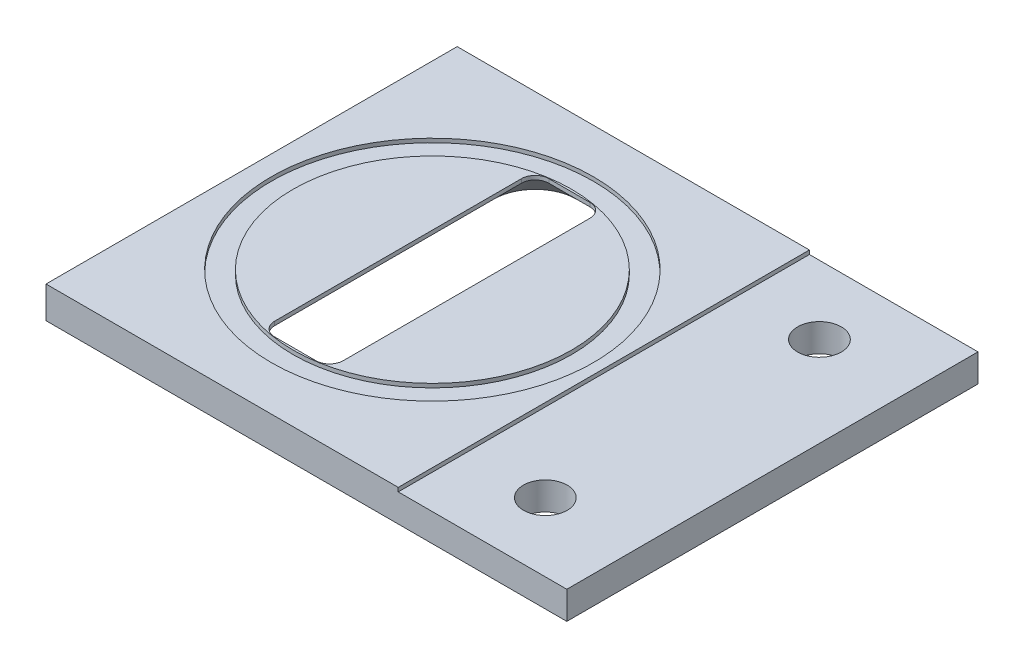
ISO-10303-21;
HEADER;
FILE_DESCRIPTION(('STEP AP214'),'2;1');
FILE_NAME('part.step','',(''),(''),'','','');
FILE_SCHEMA(('AUTOMOTIVE_DESIGN { 1 0 10303 214 1 1 1 1 }'));
ENDSEC;
DATA;
#1=APPLICATION_CONTEXT('core data for automotive mechanical design processes');
#2=APPLICATION_PROTOCOL_DEFINITION('international standard','automotive_design',2000,#1);
#3=PRODUCT_CONTEXT('',#1,'mechanical');
#4=PRODUCT('Part','Part','',(#3));
#5=PRODUCT_RELATED_PRODUCT_CATEGORY('part','',(#4));
#6=PRODUCT_DEFINITION_FORMATION('','',#4);
#7=PRODUCT_DEFINITION_CONTEXT('part definition',#1,'design');
#8=PRODUCT_DEFINITION('design','',#6,#7);
#9=PRODUCT_DEFINITION_SHAPE('','',#8);
#10=(LENGTH_UNIT() NAMED_UNIT(*) SI_UNIT(.MILLI.,.METRE.));
#11=(NAMED_UNIT(*) PLANE_ANGLE_UNIT() SI_UNIT($,.RADIAN.));
#12=(NAMED_UNIT(*) SI_UNIT($,.STERADIAN.) SOLID_ANGLE_UNIT());
#13=UNCERTAINTY_MEASURE_WITH_UNIT(LENGTH_MEASURE(1.E-05),#10,'distance_accuracy_value','');
#14=(GEOMETRIC_REPRESENTATION_CONTEXT(3) GLOBAL_UNCERTAINTY_ASSIGNED_CONTEXT((#13)) GLOBAL_UNIT_ASSIGNED_CONTEXT((#10,
#11,#12)) REPRESENTATION_CONTEXT('',''));
#15=CARTESIAN_POINT('',(0.,0.,0.));
#16=DIRECTION('',(0.,0.,1.));
#17=DIRECTION('',(1.,0.,0.));
#18=AXIS2_PLACEMENT_3D('',#15,#16,#17);
#19=CARTESIAN_POINT('',(0.,2.032,0.));
#20=DIRECTION('',(0.,1.,0.));
#21=DIRECTION('',(0.,0.,1.));
#22=AXIS2_PLACEMENT_3D('',#19,#20,#21);
#23=PLANE('',#22);
#24=CARTESIAN_POINT('',(0.,2.032,0.));
#25=DIRECTION('',(0.,1.,0.));
#26=DIRECTION('',(0.,0.,1.));
#27=AXIS2_PLACEMENT_3D('',#24,#25,#26);
#28=CIRCLE('',#27,10.1624999999998);
#29=CARTESIAN_POINT('',(0.,2.032,10.1624999999998));
#30=VERTEX_POINT('',#29);
#31=EDGE_CURVE('E196',#30,#30,#28,.T.);
#32=ORIENTED_EDGE('',*,*,#31,.F.);
#33=EDGE_LOOP('',(#32));
#34=FACE_BOUND('',#33,.T.);
#35=CARTESIAN_POINT('',(0.,2.032,0.));
#36=DIRECTION('',(0.,1.,0.));
#37=DIRECTION('',(0.,0.,1.));
#38=AXIS2_PLACEMENT_3D('',#35,#36,#37);
#39=CIRCLE('',#38,11.75);
#40=CARTESIAN_POINT('',(0.,2.032,11.75));
#41=VERTEX_POINT('',#40);
#42=EDGE_CURVE('E202',#41,#41,#39,.T.);
#43=ORIENTED_EDGE('',*,*,#42,.T.);
#44=EDGE_LOOP('',(#43));
#45=FACE_BOUND('',#44,.T.);
#46=ADVANCED_FACE('F51',(#34,#45),#23,.T.);
#47=CARTESIAN_POINT('',(24.811028753507,2.032,-15.));
#48=DIRECTION('',(-1.,0.,0.));
#49=DIRECTION('',(0.,0.,1.));
#50=AXIS2_PLACEMENT_3D('',#47,#48,#49);
#51=PLANE('',#50);
#52=DIRECTION('',(0.,0.,-1.));
#53=VECTOR('',#52,1.);
#54=CARTESIAN_POINT('',(24.811028753507,0.,-15.));
#55=LINE('',#54,#53);
#56=CARTESIAN_POINT('',(24.811028753507,0.,15.));
#57=VERTEX_POINT('',#56);
#58=CARTESIAN_POINT('',(24.811028753507,0.,-15.));
#59=VERTEX_POINT('',#58);
#60=EDGE_CURVE('E290',#57,#59,#55,.T.);
#61=ORIENTED_EDGE('',*,*,#60,.T.);
#62=DIRECTION('',(0.,-1.,0.));
#63=VECTOR('',#62,1.);
#64=CARTESIAN_POINT('',(24.811028753507,2.032,-15.));
#65=LINE('',#64,#63);
#66=CARTESIAN_POINT('',(24.811028753507,2.032,-15.));
#67=VERTEX_POINT('',#66);
#68=EDGE_CURVE('E12',#67,#59,#65,.T.);
#69=ORIENTED_EDGE('',*,*,#68,.F.);
#70=DIRECTION('',(0.,0.,-1.));
#71=VECTOR('',#70,1.);
#72=CARTESIAN_POINT('',(24.811028753507,2.032,-15.));
#73=LINE('',#72,#71);
#74=CARTESIAN_POINT('',(24.811028753507,2.032,15.));
#75=VERTEX_POINT('',#74);
#76=EDGE_CURVE('E310',#75,#67,#73,.T.);
#77=ORIENTED_EDGE('',*,*,#76,.F.);
#78=DIRECTION('',(0.,-1.,0.));
#79=VECTOR('',#78,1.);
#80=CARTESIAN_POINT('',(24.811028753507,2.032,15.));
#81=LINE('',#80,#79);
#82=EDGE_CURVE('E318',#75,#57,#81,.T.);
#83=ORIENTED_EDGE('',*,*,#82,.T.);
#84=EDGE_LOOP('',(#61,#69,#77,#83));
#85=FACE_BOUND('',#84,.T.);
#86=ADVANCED_FACE('F53',(#85),#51,.F.);
#87=CARTESIAN_POINT('',(-13.188971246493,2.032,-15.));
#88=DIRECTION('',(0.,0.,1.));
#89=DIRECTION('',(1.,0.,0.));
#90=AXIS2_PLACEMENT_3D('',#87,#88,#89);
#91=PLANE('',#90);
#92=DIRECTION('',(-1.,0.,0.));
#93=VECTOR('',#92,1.);
#94=CARTESIAN_POINT('',(-13.188971246493,0.,-15.));
#95=LINE('',#94,#93);
#96=CARTESIAN_POINT('',(-13.188971246493,0.,-15.));
#97=VERTEX_POINT('',#96);
#98=EDGE_CURVE('E321',#59,#97,#95,.T.);
#99=ORIENTED_EDGE('',*,*,#98,.T.);
#100=DIRECTION('',(0.,-1.,0.));
#101=VECTOR('',#100,1.);
#102=CARTESIAN_POINT('',(-13.188971246493,2.032,-15.));
#103=LINE('',#102,#101);
#104=CARTESIAN_POINT('',(-13.188971246493,2.3194,-15.));
#105=VERTEX_POINT('',#104);
#106=EDGE_CURVE('E59',#105,#97,#103,.T.);
#107=ORIENTED_EDGE('',*,*,#106,.F.);
#108=DIRECTION('',(-1.,0.,0.));
#109=VECTOR('',#108,1.);
#110=CARTESIAN_POINT('',(0.,2.3194,-15.));
#111=LINE('',#110,#109);
#112=CARTESIAN_POINT('',(12.511028753507,2.3194,-15.));
#113=VERTEX_POINT('',#112);
#114=EDGE_CURVE('E218',#113,#105,#111,.T.);
#115=ORIENTED_EDGE('',*,*,#114,.F.);
#116=DIRECTION('',(0.,-1.,0.));
#117=VECTOR('',#116,1.);
#118=CARTESIAN_POINT('',(12.511028753507,2.3194,-15.));
#119=LINE('',#118,#117);
#120=CARTESIAN_POINT('',(12.511028753507,2.032,-15.));
#121=VERTEX_POINT('',#120);
#122=EDGE_CURVE('E223',#113,#121,#119,.T.);
#123=ORIENTED_EDGE('',*,*,#122,.T.);
#124=DIRECTION('',(-1.,0.,0.));
#125=VECTOR('',#124,1.);
#126=CARTESIAN_POINT('',(-13.188971246493,2.032,-15.));
#127=LINE('',#126,#125);
#128=EDGE_CURVE('E313',#67,#121,#127,.T.);
#129=ORIENTED_EDGE('',*,*,#128,.F.);
#130=ORIENTED_EDGE('',*,*,#68,.T.);
#131=EDGE_LOOP('',(#99,#107,#115,#123,#129,#130));
#132=FACE_BOUND('',#131,.T.);
#133=ADVANCED_FACE('F356',(#132),#91,.F.);
#134=CARTESIAN_POINT('',(-13.188971246493,2.032,-15.));
#135=DIRECTION('',(1.,0.,0.));
#136=DIRECTION('',(0.,0.,-1.));
#137=AXIS2_PLACEMENT_3D('',#134,#135,#136);
#138=PLANE('',#137);
#139=DIRECTION('',(0.,0.,1.));
#140=VECTOR('',#139,1.);
#141=CARTESIAN_POINT('',(-13.188971246493,0.,-15.));
#142=LINE('',#141,#140);
#143=CARTESIAN_POINT('',(-13.188971246493,0.,15.));
#144=VERTEX_POINT('',#143);
#145=EDGE_CURVE('E323',#97,#144,#142,.T.);
#146=ORIENTED_EDGE('',*,*,#145,.T.);
#147=DIRECTION('',(0.,-1.,0.));
#148=VECTOR('',#147,1.);
#149=CARTESIAN_POINT('',(-13.188971246493,2.032,15.));
#150=LINE('',#149,#148);
#151=CARTESIAN_POINT('',(-13.188971246493,2.3194,15.));
#152=VERTEX_POINT('',#151);
#153=EDGE_CURVE('E328',#152,#144,#150,.T.);
#154=ORIENTED_EDGE('',*,*,#153,.F.);
#155=DIRECTION('',(0.,0.,1.));
#156=VECTOR('',#155,1.);
#157=CARTESIAN_POINT('',(-13.188971246493,2.3194,0.));
#158=LINE('',#157,#156);
#159=EDGE_CURVE('E221',#105,#152,#158,.T.);
#160=ORIENTED_EDGE('',*,*,#159,.F.);
#161=ORIENTED_EDGE('',*,*,#106,.T.);
#162=EDGE_LOOP('',(#146,#154,#160,#161));
#163=FACE_BOUND('',#162,.T.);
#164=ADVANCED_FACE('F334',(#163),#138,.F.);
#165=CARTESIAN_POINT('',(-13.188971246493,2.032,15.));
#166=DIRECTION('',(0.,0.,-1.));
#167=DIRECTION('',(-1.,0.,0.));
#168=AXIS2_PLACEMENT_3D('',#165,#166,#167);
#169=PLANE('',#168);
#170=DIRECTION('',(1.,0.,0.));
#171=VECTOR('',#170,1.);
#172=CARTESIAN_POINT('',(-13.188971246493,0.,15.));
#173=LINE('',#172,#171);
#174=EDGE_CURVE('E314',#144,#57,#173,.T.);
#175=ORIENTED_EDGE('',*,*,#174,.T.);
#176=ORIENTED_EDGE('',*,*,#82,.F.);
#177=DIRECTION('',(1.,0.,0.));
#178=VECTOR('',#177,1.);
#179=CARTESIAN_POINT('',(-13.188971246493,2.032,15.));
#180=LINE('',#179,#178);
#181=CARTESIAN_POINT('',(12.511028753507,2.032,15.));
#182=VERTEX_POINT('',#181);
#183=EDGE_CURVE('E316',#182,#75,#180,.T.);
#184=ORIENTED_EDGE('',*,*,#183,.F.);
#185=DIRECTION('',(0.,-1.,0.));
#186=VECTOR('',#185,1.);
#187=CARTESIAN_POINT('',(12.511028753507,2.3194,15.));
#188=LINE('',#187,#186);
#189=CARTESIAN_POINT('',(12.511028753507,2.3194,15.));
#190=VERTEX_POINT('',#189);
#191=EDGE_CURVE('E228',#190,#182,#188,.T.);
#192=ORIENTED_EDGE('',*,*,#191,.F.);
#193=DIRECTION('',(1.,0.,0.));
#194=VECTOR('',#193,1.);
#195=CARTESIAN_POINT('',(0.,2.3194,15.));
#196=LINE('',#195,#194);
#197=EDGE_CURVE('E213',#152,#190,#196,.T.);
#198=ORIENTED_EDGE('',*,*,#197,.F.);
#199=ORIENTED_EDGE('',*,*,#153,.T.);
#200=EDGE_LOOP('',(#175,#176,#184,#192,#198,#199));
#201=FACE_BOUND('',#200,.T.);
#202=ADVANCED_FACE('F343',(#201),#169,.F.);
#203=DIRECTION('',(0.,0.,-1.));
#204=VECTOR('',#203,1.);
#205=CARTESIAN_POINT('',(12.511028753507,2.032,0.));
#206=LINE('',#205,#204);
#207=EDGE_CURVE('E66',#182,#121,#206,.T.);
#208=ORIENTED_EDGE('',*,*,#207,.F.);
#209=ORIENTED_EDGE('',*,*,#183,.T.);
#210=ORIENTED_EDGE('',*,*,#76,.T.);
#211=ORIENTED_EDGE('',*,*,#128,.T.);
#212=EDGE_LOOP('',(#208,#209,#210,#211));
#213=FACE_BOUND('',#212,.T.);
#214=CARTESIAN_POINT('',(18.2427076959604,2.032,10.));
#215=DIRECTION('',(0.,1.,0.));
#216=DIRECTION('',(0.,0.,1.));
#217=AXIS2_PLACEMENT_3D('',#214,#215,#216);
#218=CIRCLE('',#217,1.595);
#219=CARTESIAN_POINT('',(18.2427076959604,2.032,11.595));
#220=VERTEX_POINT('',#219);
#221=EDGE_CURVE('E236',#220,#220,#218,.T.);
#222=ORIENTED_EDGE('',*,*,#221,.F.);
#223=EDGE_LOOP('',(#222));
#224=FACE_BOUND('',#223,.T.);
#225=CARTESIAN_POINT('',(18.2427076959604,2.032,-10.));
#226=DIRECTION('',(0.,1.,0.));
#227=DIRECTION('',(0.,0.,1.));
#228=AXIS2_PLACEMENT_3D('',#225,#226,#227);
#229=CIRCLE('',#228,1.595);
#230=CARTESIAN_POINT('',(18.2427076959604,2.032,-8.405));
#231=VERTEX_POINT('',#230);
#232=EDGE_CURVE('E231',#231,#231,#229,.T.);
#233=ORIENTED_EDGE('',*,*,#232,.F.);
#234=EDGE_LOOP('',(#233));
#235=FACE_BOUND('',#234,.T.);
#236=ADVANCED_FACE('F348',(#213,#224,#235),#23,.T.);
#237=CARTESIAN_POINT('',(0.,0.,0.));
#238=DIRECTION('',(0.,1.,0.));
#239=DIRECTION('',(0.,0.,1.));
#240=AXIS2_PLACEMENT_3D('',#237,#238,#239);
#241=PLANE('',#240);
#242=CARTESIAN_POINT('',(18.2427076959604,0.,10.));
#243=DIRECTION('',(0.,1.,0.));
#244=DIRECTION('',(0.,0.,1.));
#245=AXIS2_PLACEMENT_3D('',#242,#243,#244);
#246=CIRCLE('',#245,1.595);
#247=CARTESIAN_POINT('',(18.2427076959604,0.,11.595));
#248=VERTEX_POINT('',#247);
#249=EDGE_CURVE('E232',#248,#248,#246,.T.);
#250=ORIENTED_EDGE('',*,*,#249,.T.);
#251=EDGE_LOOP('',(#250));
#252=FACE_BOUND('',#251,.T.);
#253=CARTESIAN_POINT('',(18.2427076959604,0.,-10.));
#254=DIRECTION('',(0.,1.,0.));
#255=DIRECTION('',(0.,0.,1.));
#256=AXIS2_PLACEMENT_3D('',#253,#254,#255);
#257=CIRCLE('',#256,1.595);
#258=CARTESIAN_POINT('',(18.2427076959604,0.,-8.405));
#259=VERTEX_POINT('',#258);
#260=EDGE_CURVE('E239',#259,#259,#257,.T.);
#261=ORIENTED_EDGE('',*,*,#260,.T.);
#262=EDGE_LOOP('',(#261));
#263=FACE_BOUND('',#262,.T.);
#264=DIRECTION('',(1.,0.,0.));
#265=VECTOR('',#264,1.);
#266=CARTESIAN_POINT('',(1.5,0.,12.032));
#267=LINE('',#266,#265);
#268=CARTESIAN_POINT('',(-1.5,0.,12.032));
#269=VERTEX_POINT('',#268);
#270=CARTESIAN_POINT('',(1.5,0.,12.032));
#271=VERTEX_POINT('',#270);
#272=EDGE_CURVE('E268',#269,#271,#267,.T.);
#273=ORIENTED_EDGE('',*,*,#272,.T.);
#274=CARTESIAN_POINT('',(1.5,0.,9.));
#275=DIRECTION('',(0.,1.,0.));
#276=DIRECTION('',(0.,0.,1.));
#277=AXIS2_PLACEMENT_3D('',#274,#275,#276);
#278=CIRCLE('',#277,3.03200000000001);
#279=CARTESIAN_POINT('',(4.53200000000001,0.,9.));
#280=VERTEX_POINT('',#279);
#281=EDGE_CURVE('E264',#271,#280,#278,.T.);
#282=ORIENTED_EDGE('',*,*,#281,.T.);
#283=DIRECTION('',(0.,0.,-1.));
#284=VECTOR('',#283,1.);
#285=CARTESIAN_POINT('',(4.53200000000001,0.,9.));
#286=LINE('',#285,#284);
#287=CARTESIAN_POINT('',(4.53200000000001,0.,-9.));
#288=VERTEX_POINT('',#287);
#289=EDGE_CURVE('E267',#280,#288,#286,.T.);
#290=ORIENTED_EDGE('',*,*,#289,.T.);
#291=CARTESIAN_POINT('',(1.5,0.,-9.));
#292=DIRECTION('',(0.,1.,0.));
#293=DIRECTION('',(0.,0.,1.));
#294=AXIS2_PLACEMENT_3D('',#291,#292,#293);
#295=CIRCLE('',#294,3.03200000000001);
#296=CARTESIAN_POINT('',(1.5,0.,-12.032));
#297=VERTEX_POINT('',#296);
#298=EDGE_CURVE('E74',#288,#297,#295,.T.);
#299=ORIENTED_EDGE('',*,*,#298,.T.);
#300=DIRECTION('',(-1.,0.,0.));
#301=VECTOR('',#300,1.);
#302=CARTESIAN_POINT('',(1.5,0.,-12.032));
#303=LINE('',#302,#301);
#304=CARTESIAN_POINT('',(-1.5,0.,-12.032));
#305=VERTEX_POINT('',#304);
#306=EDGE_CURVE('E281',#297,#305,#303,.T.);
#307=ORIENTED_EDGE('',*,*,#306,.T.);
#308=CARTESIAN_POINT('',(-1.5,0.,-9.));
#309=DIRECTION('',(0.,1.,0.));
#310=DIRECTION('',(0.,0.,1.));
#311=AXIS2_PLACEMENT_3D('',#308,#309,#310);
#312=CIRCLE('',#311,3.03200000000001);
#313=CARTESIAN_POINT('',(-4.53200000000001,0.,-9.));
#314=VERTEX_POINT('',#313);
#315=EDGE_CURVE('E278',#305,#314,#312,.T.);
#316=ORIENTED_EDGE('',*,*,#315,.T.);
#317=DIRECTION('',(0.,0.,1.));
#318=VECTOR('',#317,1.);
#319=CARTESIAN_POINT('',(-4.53200000000001,0.,9.));
#320=LINE('',#319,#318);
#321=CARTESIAN_POINT('',(-4.53200000000001,0.,9.));
#322=VERTEX_POINT('',#321);
#323=EDGE_CURVE('E275',#314,#322,#320,.T.);
#324=ORIENTED_EDGE('',*,*,#323,.T.);
#325=CARTESIAN_POINT('',(-1.5,0.,9.));
#326=DIRECTION('',(0.,1.,0.));
#327=DIRECTION('',(0.,0.,1.));
#328=AXIS2_PLACEMENT_3D('',#325,#326,#327);
#329=CIRCLE('',#328,3.03200000000001);
#330=EDGE_CURVE('E272',#322,#269,#329,.T.);
#331=ORIENTED_EDGE('',*,*,#330,.T.);
#332=EDGE_LOOP('',(#273,#282,#290,#299,#307,#316,#324,#331));
#333=FACE_BOUND('',#332,.T.);
#334=ORIENTED_EDGE('',*,*,#60,.F.);
#335=ORIENTED_EDGE('',*,*,#174,.F.);
#336=ORIENTED_EDGE('',*,*,#145,.F.);
#337=ORIENTED_EDGE('',*,*,#98,.F.);
#338=EDGE_LOOP('',(#334,#335,#336,#337));
#339=FACE_BOUND('',#338,.T.);
#340=ADVANCED_FACE('F340',(#252,#263,#333,#339),#241,.F.);
#341=CARTESIAN_POINT('',(1.5,2.032,9.));
#342=DIRECTION('',(0.,-1.,0.));
#343=DIRECTION('',(0.,0.,1.));
#344=AXIS2_PLACEMENT_3D('',#341,#342,#343);
#345=CONICAL_SURFACE('',#344,1.,0.78539816339745);
#346=CARTESIAN_POINT('',(1.5,2.032,9.));
#347=DIRECTION('',(0.,1.,0.));
#348=DIRECTION('',(0.,0.,1.));
#349=AXIS2_PLACEMENT_3D('',#346,#347,#348);
#350=CIRCLE('',#349,1.);
#351=CARTESIAN_POINT('',(1.5,2.032,10.));
#352=VERTEX_POINT('',#351);
#353=CARTESIAN_POINT('',(2.5,2.032,9.));
#354=VERTEX_POINT('',#353);
#355=EDGE_CURVE('E235',#352,#354,#350,.T.);
#356=ORIENTED_EDGE('',*,*,#355,.T.);
#357=DIRECTION('',(0.707106781186549,-0.707106781186546,0.));
#358=VECTOR('',#357,1.);
#359=CARTESIAN_POINT('',(2.5,2.032,9.));
#360=LINE('',#359,#358);
#361=EDGE_CURVE('E271',#280,#354,#360,.F.);
#362=ORIENTED_EDGE('',*,*,#361,.F.);
#363=ORIENTED_EDGE('',*,*,#281,.F.);
#364=DIRECTION('',(0.,-0.707106781186546,0.707106781186549));
#365=VECTOR('',#364,1.);
#366=CARTESIAN_POINT('',(1.5,2.032,10.));
#367=LINE('',#366,#365);
#368=EDGE_CURVE('E287',#271,#352,#367,.F.);
#369=ORIENTED_EDGE('',*,*,#368,.T.);
#370=EDGE_LOOP('',(#356,#362,#363,#369));
#371=FACE_BOUND('',#370,.T.);
#372=ADVANCED_FACE('F377',(#371),#345,.F.);
#373=CARTESIAN_POINT('',(1.5,2.032,10.));
#374=DIRECTION('',(0.,0.707106781186549,0.707106781186546));
#375=DIRECTION('',(0.,-0.707106781186546,0.707106781186549));
#376=AXIS2_PLACEMENT_3D('',#373,#374,#375);
#377=PLANE('',#376);
#378=DIRECTION('',(1.,0.,0.));
#379=VECTOR('',#378,1.);
#380=CARTESIAN_POINT('',(1.5,2.032,10.));
#381=LINE('',#380,#379);
#382=CARTESIAN_POINT('',(-1.5,2.032,10.));
#383=VERTEX_POINT('',#382);
#384=EDGE_CURVE('E261',#383,#352,#381,.T.);
#385=ORIENTED_EDGE('',*,*,#384,.T.);
#386=ORIENTED_EDGE('',*,*,#368,.F.);
#387=ORIENTED_EDGE('',*,*,#272,.F.);
#388=DIRECTION('',(0.,-0.707106781186546,0.707106781186549));
#389=VECTOR('',#388,1.);
#390=CARTESIAN_POINT('',(-1.5,2.032,10.));
#391=LINE('',#390,#389);
#392=EDGE_CURVE('E291',#269,#383,#391,.F.);
#393=ORIENTED_EDGE('',*,*,#392,.T.);
#394=EDGE_LOOP('',(#385,#386,#387,#393));
#395=FACE_BOUND('',#394,.T.);
#396=ADVANCED_FACE('F461',(#395),#377,.F.);
#397=CARTESIAN_POINT('',(-1.5,2.032,9.));
#398=DIRECTION('',(0.,-1.,0.));
#399=DIRECTION('',(0.,0.,-1.));
#400=AXIS2_PLACEMENT_3D('',#397,#398,#399);
#401=CONICAL_SURFACE('',#400,1.,0.78539816339745);
#402=CARTESIAN_POINT('',(-1.5,2.032,9.));
#403=DIRECTION('',(0.,1.,0.));
#404=DIRECTION('',(0.,0.,-1.));
#405=AXIS2_PLACEMENT_3D('',#402,#403,#404);
#406=CIRCLE('',#405,1.);
#407=CARTESIAN_POINT('',(-2.5,2.032,9.));
#408=VERTEX_POINT('',#407);
#409=EDGE_CURVE('E258',#408,#383,#406,.T.);
#410=ORIENTED_EDGE('',*,*,#409,.T.);
#411=ORIENTED_EDGE('',*,*,#392,.F.);
#412=ORIENTED_EDGE('',*,*,#330,.F.);
#413=DIRECTION('',(-0.707106781186549,-0.707106781186546,0.));
#414=VECTOR('',#413,1.);
#415=CARTESIAN_POINT('',(-2.5,2.032,9.));
#416=LINE('',#415,#414);
#417=EDGE_CURVE('E305',#322,#408,#416,.F.);
#418=ORIENTED_EDGE('',*,*,#417,.T.);
#419=EDGE_LOOP('',(#410,#411,#412,#418));
#420=FACE_BOUND('',#419,.T.);
#421=ADVANCED_FACE('F471',(#420),#401,.F.);
#422=CARTESIAN_POINT('',(-2.5,2.032,9.));
#423=DIRECTION('',(-0.707106781186546,0.707106781186549,0.));
#424=DIRECTION('',(-0.707106781186549,-0.707106781186546,0.));
#425=AXIS2_PLACEMENT_3D('',#422,#423,#424);
#426=PLANE('',#425);
#427=DIRECTION('',(0.,0.,1.));
#428=VECTOR('',#427,1.);
#429=CARTESIAN_POINT('',(-2.5,2.032,9.));
#430=LINE('',#429,#428);
#431=CARTESIAN_POINT('',(-2.5,2.032,-9.));
#432=VERTEX_POINT('',#431);
#433=EDGE_CURVE('E255',#432,#408,#430,.T.);
#434=ORIENTED_EDGE('',*,*,#433,.T.);
#435=ORIENTED_EDGE('',*,*,#417,.F.);
#436=ORIENTED_EDGE('',*,*,#323,.F.);
#437=DIRECTION('',(-0.707106781186549,-0.707106781186546,0.));
#438=VECTOR('',#437,1.);
#439=CARTESIAN_POINT('',(-2.5,2.032,-9.));
#440=LINE('',#439,#438);
#441=EDGE_CURVE('E302',#314,#432,#440,.F.);
#442=ORIENTED_EDGE('',*,*,#441,.T.);
#443=EDGE_LOOP('',(#434,#435,#436,#442));
#444=FACE_BOUND('',#443,.T.);
#445=ADVANCED_FACE('F480',(#444),#426,.F.);
#446=CARTESIAN_POINT('',(-1.5,2.032,-9.));
#447=DIRECTION('',(0.,-1.,0.));
#448=DIRECTION('',(0.,0.,1.));
#449=AXIS2_PLACEMENT_3D('',#446,#447,#448);
#450=CONICAL_SURFACE('',#449,1.,0.78539816339745);
#451=CARTESIAN_POINT('',(-1.5,2.032,-9.));
#452=DIRECTION('',(0.,1.,0.));
#453=DIRECTION('',(0.,0.,1.));
#454=AXIS2_PLACEMENT_3D('',#451,#452,#453);
#455=CIRCLE('',#454,1.);
#456=CARTESIAN_POINT('',(-1.5,2.032,-10.));
#457=VERTEX_POINT('',#456);
#458=EDGE_CURVE('E252',#457,#432,#455,.T.);
#459=ORIENTED_EDGE('',*,*,#458,.T.);
#460=ORIENTED_EDGE('',*,*,#441,.F.);
#461=ORIENTED_EDGE('',*,*,#315,.F.);
#462=DIRECTION('',(0.,-0.707106781186546,-0.707106781186549));
#463=VECTOR('',#462,1.);
#464=CARTESIAN_POINT('',(-1.5,2.032,-10.));
#465=LINE('',#464,#463);
#466=EDGE_CURVE('E299',#305,#457,#465,.F.);
#467=ORIENTED_EDGE('',*,*,#466,.T.);
#468=EDGE_LOOP('',(#459,#460,#461,#467));
#469=FACE_BOUND('',#468,.T.);
#470=ADVANCED_FACE('F490',(#469),#450,.F.);
#471=CARTESIAN_POINT('',(1.5,2.032,-10.));
#472=DIRECTION('',(0.,0.707106781186549,-0.707106781186546));
#473=DIRECTION('',(0.,0.707106781186546,0.707106781186549));
#474=AXIS2_PLACEMENT_3D('',#471,#472,#473);
#475=PLANE('',#474);
#476=DIRECTION('',(-1.,0.,0.));
#477=VECTOR('',#476,1.);
#478=CARTESIAN_POINT('',(1.5,2.032,-10.));
#479=LINE('',#478,#477);
#480=CARTESIAN_POINT('',(1.5,2.032,-10.));
#481=VERTEX_POINT('',#480);
#482=EDGE_CURVE('E249',#481,#457,#479,.T.);
#483=ORIENTED_EDGE('',*,*,#482,.T.);
#484=ORIENTED_EDGE('',*,*,#466,.F.);
#485=ORIENTED_EDGE('',*,*,#306,.F.);
#486=DIRECTION('',(0.,-0.707106781186546,-0.707106781186549));
#487=VECTOR('',#486,1.);
#488=CARTESIAN_POINT('',(1.5,2.032,-10.));
#489=LINE('',#488,#487);
#490=EDGE_CURVE('E296',#297,#481,#489,.F.);
#491=ORIENTED_EDGE('',*,*,#490,.T.);
#492=EDGE_LOOP('',(#483,#484,#485,#491));
#493=FACE_BOUND('',#492,.T.);
#494=ADVANCED_FACE('F500',(#493),#475,.F.);
#495=CARTESIAN_POINT('',(1.5,2.032,-9.));
#496=DIRECTION('',(0.,-1.,0.));
#497=DIRECTION('',(0.,0.,1.));
#498=AXIS2_PLACEMENT_3D('',#495,#496,#497);
#499=CONICAL_SURFACE('',#498,1.,0.78539816339745);
#500=CARTESIAN_POINT('',(1.5,2.032,-9.));
#501=DIRECTION('',(0.,1.,0.));
#502=DIRECTION('',(0.,0.,1.));
#503=AXIS2_PLACEMENT_3D('',#500,#501,#502);
#504=CIRCLE('',#503,1.);
#505=CARTESIAN_POINT('',(2.5,2.032,-9.));
#506=VERTEX_POINT('',#505);
#507=EDGE_CURVE('E246',#506,#481,#504,.T.);
#508=ORIENTED_EDGE('',*,*,#507,.T.);
#509=ORIENTED_EDGE('',*,*,#490,.F.);
#510=ORIENTED_EDGE('',*,*,#298,.F.);
#511=DIRECTION('',(0.707106781186549,-0.707106781186546,0.));
#512=VECTOR('',#511,1.);
#513=CARTESIAN_POINT('',(2.5,2.032,-9.));
#514=LINE('',#513,#512);
#515=EDGE_CURVE('E294',#288,#506,#514,.F.);
#516=ORIENTED_EDGE('',*,*,#515,.T.);
#517=EDGE_LOOP('',(#508,#509,#510,#516));
#518=FACE_BOUND('',#517,.T.);
#519=ADVANCED_FACE('F510',(#518),#499,.F.);
#520=CARTESIAN_POINT('',(2.5,2.032,9.));
#521=DIRECTION('',(0.707106781186546,0.707106781186549,0.));
#522=DIRECTION('',(-0.707106781186549,0.707106781186546,0.));
#523=AXIS2_PLACEMENT_3D('',#520,#521,#522);
#524=PLANE('',#523);
#525=DIRECTION('',(0.,0.,-1.));
#526=VECTOR('',#525,1.);
#527=CARTESIAN_POINT('',(2.5,2.032,9.));
#528=LINE('',#527,#526);
#529=EDGE_CURVE('E200',#354,#506,#528,.T.);
#530=ORIENTED_EDGE('',*,*,#529,.T.);
#531=ORIENTED_EDGE('',*,*,#515,.F.);
#532=ORIENTED_EDGE('',*,*,#289,.F.);
#533=ORIENTED_EDGE('',*,*,#361,.T.);
#534=EDGE_LOOP('',(#530,#531,#532,#533));
#535=FACE_BOUND('',#534,.T.);
#536=ADVANCED_FACE('F418',(#535),#524,.F.);
#537=CARTESIAN_POINT('',(18.2427076959604,0.,-10.));
#538=DIRECTION('',(0.,1.,0.));
#539=DIRECTION('',(0.,0.,1.));
#540=AXIS2_PLACEMENT_3D('',#537,#538,#539);
#541=CYLINDRICAL_SURFACE('',#540,1.595);
#542=ORIENTED_EDGE('',*,*,#260,.F.);
#543=EDGE_LOOP('',(#542));
#544=FACE_BOUND('',#543,.T.);
#545=ORIENTED_EDGE('',*,*,#232,.T.);
#546=EDGE_LOOP('',(#545));
#547=FACE_BOUND('',#546,.T.);
#548=ADVANCED_FACE('F407',(#544,#547),#541,.F.);
#549=CARTESIAN_POINT('',(18.2427076959604,0.,10.));
#550=DIRECTION('',(0.,1.,0.));
#551=DIRECTION('',(0.,0.,1.));
#552=AXIS2_PLACEMENT_3D('',#549,#550,#551);
#553=CYLINDRICAL_SURFACE('',#552,1.595);
#554=ORIENTED_EDGE('',*,*,#249,.F.);
#555=EDGE_LOOP('',(#554));
#556=FACE_BOUND('',#555,.T.);
#557=ORIENTED_EDGE('',*,*,#221,.T.);
#558=EDGE_LOOP('',(#557));
#559=FACE_BOUND('',#558,.T.);
#560=ADVANCED_FACE('F403',(#556,#559),#553,.F.);
#561=CARTESIAN_POINT('',(12.511028753507,2.3194,0.));
#562=DIRECTION('',(-1.,0.,0.));
#563=DIRECTION('',(0.,0.,1.));
#564=AXIS2_PLACEMENT_3D('',#561,#562,#563);
#565=PLANE('',#564);
#566=ORIENTED_EDGE('',*,*,#207,.T.);
#567=ORIENTED_EDGE('',*,*,#122,.F.);
#568=DIRECTION('',(0.,0.,-1.));
#569=VECTOR('',#568,1.);
#570=CARTESIAN_POINT('',(12.511028753507,2.3194,0.));
#571=LINE('',#570,#569);
#572=EDGE_CURVE('E216',#190,#113,#571,.T.);
#573=ORIENTED_EDGE('',*,*,#572,.F.);
#574=ORIENTED_EDGE('',*,*,#191,.T.);
#575=EDGE_LOOP('',(#566,#567,#573,#574));
#576=FACE_BOUND('',#575,.T.);
#577=ADVANCED_FACE('F352',(#576),#565,.F.);
#578=CARTESIAN_POINT('',(0.,2.3194,0.));
#579=DIRECTION('',(0.,-1.,0.));
#580=DIRECTION('',(0.,0.,-1.));
#581=AXIS2_PLACEMENT_3D('',#578,#579,#580);
#582=CYLINDRICAL_SURFACE('',#581,11.75);
#583=CARTESIAN_POINT('',(0.,2.3194,0.));
#584=DIRECTION('',(0.,1.,0.));
#585=DIRECTION('',(0.,0.,1.));
#586=AXIS2_PLACEMENT_3D('',#583,#584,#585);
#587=CIRCLE('',#586,11.75);
#588=CARTESIAN_POINT('',(0.,2.3194,11.75));
#589=VERTEX_POINT('',#588);
#590=EDGE_CURVE('E210',#589,#589,#587,.T.);
#591=ORIENTED_EDGE('',*,*,#590,.T.);
#592=EDGE_LOOP('',(#591));
#593=FACE_BOUND('',#592,.T.);
#594=ORIENTED_EDGE('',*,*,#42,.F.);
#595=EDGE_LOOP('',(#594));
#596=FACE_BOUND('',#595,.T.);
#597=ADVANCED_FACE('F534',(#593,#596),#582,.F.);
#598=CARTESIAN_POINT('',(0.,2.3194,0.));
#599=DIRECTION('',(0.,1.,0.));
#600=DIRECTION('',(0.,0.,1.));
#601=AXIS2_PLACEMENT_3D('',#598,#599,#600);
#602=PLANE('',#601);
#603=ORIENTED_EDGE('',*,*,#590,.F.);
#604=EDGE_LOOP('',(#603));
#605=FACE_BOUND('',#604,.T.);
#606=ORIENTED_EDGE('',*,*,#197,.T.);
#607=ORIENTED_EDGE('',*,*,#572,.T.);
#608=ORIENTED_EDGE('',*,*,#114,.T.);
#609=ORIENTED_EDGE('',*,*,#159,.T.);
#610=EDGE_LOOP('',(#606,#607,#608,#609));
#611=FACE_BOUND('',#610,.T.);
#612=ADVANCED_FACE('F355',(#605,#611),#602,.T.);
#613=CARTESIAN_POINT('',(2.5,2.3194,0.));
#614=DIRECTION('',(1.,0.,0.));
#615=DIRECTION('',(0.,0.,-1.));
#616=AXIS2_PLACEMENT_3D('',#613,#614,#615);
#617=PLANE('',#616);
#618=ORIENTED_EDGE('',*,*,#529,.F.);
#619=DIRECTION('',(0.,-1.,0.));
#620=VECTOR('',#619,1.);
#621=CARTESIAN_POINT('',(2.5,2.3194,9.));
#622=LINE('',#621,#620);
#623=CARTESIAN_POINT('',(2.5,2.3194,9.));
#624=VERTEX_POINT('',#623);
#625=EDGE_CURVE('E180',#624,#354,#622,.T.);
#626=ORIENTED_EDGE('',*,*,#625,.F.);
#627=DIRECTION('',(0.,0.,1.));
#628=VECTOR('',#627,1.);
#629=CARTESIAN_POINT('',(2.5,2.3194,0.));
#630=LINE('',#629,#628);
#631=CARTESIAN_POINT('',(2.5,2.3194,-9.));
#632=VERTEX_POINT('',#631);
#633=EDGE_CURVE('E187',#632,#624,#630,.T.);
#634=ORIENTED_EDGE('',*,*,#633,.F.);
#635=DIRECTION('',(0.,-1.,0.));
#636=VECTOR('',#635,1.);
#637=CARTESIAN_POINT('',(2.5,2.3194,-9.));
#638=LINE('',#637,#636);
#639=EDGE_CURVE('E668',#632,#506,#638,.T.);
#640=ORIENTED_EDGE('',*,*,#639,.T.);
#641=EDGE_LOOP('',(#618,#626,#634,#640));
#642=FACE_BOUND('',#641,.T.);
#643=ADVANCED_FACE('F198',(#642),#617,.F.);
#644=CARTESIAN_POINT('',(1.5,2.3194,9.));
#645=DIRECTION('',(0.,-1.,0.));
#646=DIRECTION('',(0.,0.,-1.));
#647=AXIS2_PLACEMENT_3D('',#644,#645,#646);
#648=CYLINDRICAL_SURFACE('',#647,1.);
#649=ORIENTED_EDGE('',*,*,#355,.F.);
#650=DIRECTION('',(0.,-1.,0.));
#651=VECTOR('',#650,1.);
#652=CARTESIAN_POINT('',(1.5,2.3194,10.));
#653=LINE('',#652,#651);
#654=CARTESIAN_POINT('',(1.5,2.3194,10.));
#655=VERTEX_POINT('',#654);
#656=EDGE_CURVE('E183',#655,#352,#653,.T.);
#657=ORIENTED_EDGE('',*,*,#656,.F.);
#658=CARTESIAN_POINT('',(1.5,2.3194,9.));
#659=DIRECTION('',(0.,1.,0.));
#660=DIRECTION('',(0.,0.,1.));
#661=AXIS2_PLACEMENT_3D('',#658,#659,#660);
#662=CIRCLE('',#661,1.);
#663=EDGE_CURVE('E176',#624,#655,#662,.F.);
#664=ORIENTED_EDGE('',*,*,#663,.F.);
#665=ORIENTED_EDGE('',*,*,#625,.T.);
#666=EDGE_LOOP('',(#649,#657,#664,#665));
#667=FACE_BOUND('',#666,.T.);
#668=ADVANCED_FACE('F178',(#667),#648,.F.);
#669=CARTESIAN_POINT('',(0.,2.3194,10.));
#670=DIRECTION('',(0.,0.,1.));
#671=DIRECTION('',(1.,0.,0.));
#672=AXIS2_PLACEMENT_3D('',#669,#670,#671);
#673=PLANE('',#672);
#674=ORIENTED_EDGE('',*,*,#384,.F.);
#675=DIRECTION('',(0.,-1.,0.));
#676=VECTOR('',#675,1.);
#677=CARTESIAN_POINT('',(-1.5,2.3194,10.));
#678=LINE('',#677,#676);
#679=CARTESIAN_POINT('',(-1.5,2.3194,10.));
#680=VERTEX_POINT('',#679);
#681=EDGE_CURVE('E206',#680,#383,#678,.T.);
#682=ORIENTED_EDGE('',*,*,#681,.F.);
#683=DIRECTION('',(-1.,0.,0.));
#684=VECTOR('',#683,1.);
#685=CARTESIAN_POINT('',(0.,2.3194,10.));
#686=LINE('',#685,#684);
#687=EDGE_CURVE('E186',#655,#680,#686,.T.);
#688=ORIENTED_EDGE('',*,*,#687,.F.);
#689=ORIENTED_EDGE('',*,*,#656,.T.);
#690=EDGE_LOOP('',(#674,#682,#688,#689));
#691=FACE_BOUND('',#690,.T.);
#692=ADVANCED_FACE('F571',(#691),#673,.F.);
#693=CARTESIAN_POINT('',(-1.5,2.3194,9.));
#694=DIRECTION('',(0.,-1.,0.));
#695=DIRECTION('',(0.,0.,-1.));
#696=AXIS2_PLACEMENT_3D('',#693,#694,#695);
#697=CYLINDRICAL_SURFACE('',#696,1.);
#698=ORIENTED_EDGE('',*,*,#409,.F.);
#699=DIRECTION('',(0.,-1.,0.));
#700=VECTOR('',#699,1.);
#701=CARTESIAN_POINT('',(-2.5,2.3194,9.));
#702=LINE('',#701,#700);
#703=CARTESIAN_POINT('',(-2.5,2.3194,9.));
#704=VERTEX_POINT('',#703);
#705=EDGE_CURVE('E679',#704,#408,#702,.T.);
#706=ORIENTED_EDGE('',*,*,#705,.F.);
#707=CARTESIAN_POINT('',(-1.5,2.3194,9.));
#708=DIRECTION('',(0.,1.,0.));
#709=DIRECTION('',(0.,0.,1.));
#710=AXIS2_PLACEMENT_3D('',#707,#708,#709);
#711=CIRCLE('',#710,1.);
#712=EDGE_CURVE('E685',#680,#704,#711,.F.);
#713=ORIENTED_EDGE('',*,*,#712,.F.);
#714=ORIENTED_EDGE('',*,*,#681,.T.);
#715=EDGE_LOOP('',(#698,#706,#713,#714));
#716=FACE_BOUND('',#715,.T.);
#717=ADVANCED_FACE('F581',(#716),#697,.F.);
#718=CARTESIAN_POINT('',(-2.5,2.3194,0.));
#719=DIRECTION('',(-1.,0.,0.));
#720=DIRECTION('',(0.,0.,1.));
#721=AXIS2_PLACEMENT_3D('',#718,#719,#720);
#722=PLANE('',#721);
#723=ORIENTED_EDGE('',*,*,#433,.F.);
#724=DIRECTION('',(0.,-1.,0.));
#725=VECTOR('',#724,1.);
#726=CARTESIAN_POINT('',(-2.5,2.3194,-9.));
#727=LINE('',#726,#725);
#728=CARTESIAN_POINT('',(-2.5,2.3194,-9.));
#729=VERTEX_POINT('',#728);
#730=EDGE_CURVE('E676',#729,#432,#727,.T.);
#731=ORIENTED_EDGE('',*,*,#730,.F.);
#732=DIRECTION('',(0.,0.,-1.));
#733=VECTOR('',#732,1.);
#734=CARTESIAN_POINT('',(-2.5,2.3194,0.));
#735=LINE('',#734,#733);
#736=EDGE_CURVE('E696',#704,#729,#735,.T.);
#737=ORIENTED_EDGE('',*,*,#736,.F.);
#738=ORIENTED_EDGE('',*,*,#705,.T.);
#739=EDGE_LOOP('',(#723,#731,#737,#738));
#740=FACE_BOUND('',#739,.T.);
#741=ADVANCED_FACE('F593',(#740),#722,.F.);
#742=CARTESIAN_POINT('',(-1.5,2.3194,-9.));
#743=DIRECTION('',(0.,-1.,0.));
#744=DIRECTION('',(0.,0.,-1.));
#745=AXIS2_PLACEMENT_3D('',#742,#743,#744);
#746=CYLINDRICAL_SURFACE('',#745,1.);
#747=ORIENTED_EDGE('',*,*,#458,.F.);
#748=DIRECTION('',(0.,-1.,0.));
#749=VECTOR('',#748,1.);
#750=CARTESIAN_POINT('',(-1.5,2.3194,-10.));
#751=LINE('',#750,#749);
#752=CARTESIAN_POINT('',(-1.5,2.3194,-10.));
#753=VERTEX_POINT('',#752);
#754=EDGE_CURVE('E673',#753,#457,#751,.T.);
#755=ORIENTED_EDGE('',*,*,#754,.F.);
#756=CARTESIAN_POINT('',(-1.5,2.3194,-9.));
#757=DIRECTION('',(0.,1.,0.));
#758=DIRECTION('',(0.,0.,1.));
#759=AXIS2_PLACEMENT_3D('',#756,#757,#758);
#760=CIRCLE('',#759,1.);
#761=EDGE_CURVE('E693',#729,#753,#760,.F.);
#762=ORIENTED_EDGE('',*,*,#761,.F.);
#763=ORIENTED_EDGE('',*,*,#730,.T.);
#764=EDGE_LOOP('',(#747,#755,#762,#763));
#765=FACE_BOUND('',#764,.T.);
#766=ADVANCED_FACE('F604',(#765),#746,.F.);
#767=CARTESIAN_POINT('',(0.,2.3194,-10.));
#768=DIRECTION('',(0.,0.,-1.));
#769=DIRECTION('',(-1.,0.,0.));
#770=AXIS2_PLACEMENT_3D('',#767,#768,#769);
#771=PLANE('',#770);
#772=ORIENTED_EDGE('',*,*,#482,.F.);
#773=DIRECTION('',(0.,-1.,0.));
#774=VECTOR('',#773,1.);
#775=CARTESIAN_POINT('',(1.5,2.3194,-10.));
#776=LINE('',#775,#774);
#777=CARTESIAN_POINT('',(1.5,2.3194,-10.));
#778=VERTEX_POINT('',#777);
#779=EDGE_CURVE('E670',#778,#481,#776,.T.);
#780=ORIENTED_EDGE('',*,*,#779,.F.);
#781=DIRECTION('',(1.,0.,0.));
#782=VECTOR('',#781,1.);
#783=CARTESIAN_POINT('',(0.,2.3194,-10.));
#784=LINE('',#783,#782);
#785=EDGE_CURVE('E695',#753,#778,#784,.T.);
#786=ORIENTED_EDGE('',*,*,#785,.F.);
#787=ORIENTED_EDGE('',*,*,#754,.T.);
#788=EDGE_LOOP('',(#772,#780,#786,#787));
#789=FACE_BOUND('',#788,.T.);
#790=ADVANCED_FACE('F615',(#789),#771,.F.);
#791=CARTESIAN_POINT('',(1.5,2.3194,-9.));
#792=DIRECTION('',(0.,-1.,0.));
#793=DIRECTION('',(0.,0.,-1.));
#794=AXIS2_PLACEMENT_3D('',#791,#792,#793);
#795=CYLINDRICAL_SURFACE('',#794,1.);
#796=ORIENTED_EDGE('',*,*,#507,.F.);
#797=ORIENTED_EDGE('',*,*,#639,.F.);
#798=CARTESIAN_POINT('',(1.5,2.3194,-9.));
#799=DIRECTION('',(0.,1.,0.));
#800=DIRECTION('',(0.,0.,1.));
#801=AXIS2_PLACEMENT_3D('',#798,#799,#800);
#802=CIRCLE('',#801,1.);
#803=EDGE_CURVE('E193',#778,#632,#802,.F.);
#804=ORIENTED_EDGE('',*,*,#803,.F.);
#805=ORIENTED_EDGE('',*,*,#779,.T.);
#806=EDGE_LOOP('',(#796,#797,#804,#805));
#807=FACE_BOUND('',#806,.T.);
#808=ADVANCED_FACE('F626',(#807),#795,.F.);
#809=CARTESIAN_POINT('',(0.,2.3194,0.));
#810=DIRECTION('',(0.,-1.,0.));
#811=DIRECTION('',(0.,0.,-1.));
#812=AXIS2_PLACEMENT_3D('',#809,#810,#811);
#813=CYLINDRICAL_SURFACE('',#812,10.1624999999998);
#814=CARTESIAN_POINT('',(0.,2.3194,0.));
#815=DIRECTION('',(0.,1.,0.));
#816=DIRECTION('',(0.,0.,1.));
#817=AXIS2_PLACEMENT_3D('',#814,#815,#816);
#818=CIRCLE('',#817,10.1624999999998);
#819=CARTESIAN_POINT('',(0.,2.3194,10.1624999999998));
#820=VERTEX_POINT('',#819);
#821=EDGE_CURVE('E662',#820,#820,#818,.T.);
#822=ORIENTED_EDGE('',*,*,#821,.F.);
#823=EDGE_LOOP('',(#822));
#824=FACE_BOUND('',#823,.T.);
#825=ORIENTED_EDGE('',*,*,#31,.T.);
#826=EDGE_LOOP('',(#825));
#827=FACE_BOUND('',#826,.T.);
#828=ADVANCED_FACE('F637',(#824,#827),#813,.T.);
#829=CARTESIAN_POINT('',(0.,2.3194,0.));
#830=DIRECTION('',(0.,1.,0.));
#831=DIRECTION('',(0.,0.,1.));
#832=AXIS2_PLACEMENT_3D('',#829,#830,#831);
#833=PLANE('',#832);
#834=ORIENTED_EDGE('',*,*,#633,.T.);
#835=ORIENTED_EDGE('',*,*,#663,.T.);
#836=ORIENTED_EDGE('',*,*,#687,.T.);
#837=ORIENTED_EDGE('',*,*,#712,.T.);
#838=ORIENTED_EDGE('',*,*,#736,.T.);
#839=ORIENTED_EDGE('',*,*,#761,.T.);
#840=ORIENTED_EDGE('',*,*,#785,.T.);
#841=ORIENTED_EDGE('',*,*,#803,.T.);
#842=EDGE_LOOP('',(#834,#835,#836,#837,#838,#839,#840,#841));
#843=FACE_BOUND('',#842,.T.);
#844=ORIENTED_EDGE('',*,*,#821,.T.);
#845=EDGE_LOOP('',(#844));
#846=FACE_BOUND('',#845,.T.);
#847=ADVANCED_FACE('F190',(#843,#846),#833,.T.);
#848=CLOSED_SHELL('',(#46,#86,#133,#164,#202,#236,#340,#372,#396,#421,#445,#470,#494,#519,#536,
#548,#560,#577,#597,#612,#643,#668,#692,#717,#741,#766,#790,#808,#828,#847));
#849=MANIFOLD_SOLID_BREP('B2',#848);
#850=ADVANCED_BREP_SHAPE_REPRESENTATION('',(#18,#849),#14);
#851=SHAPE_DEFINITION_REPRESENTATION(#9,#850);
ENDSEC;
END-ISO-10303-21;
